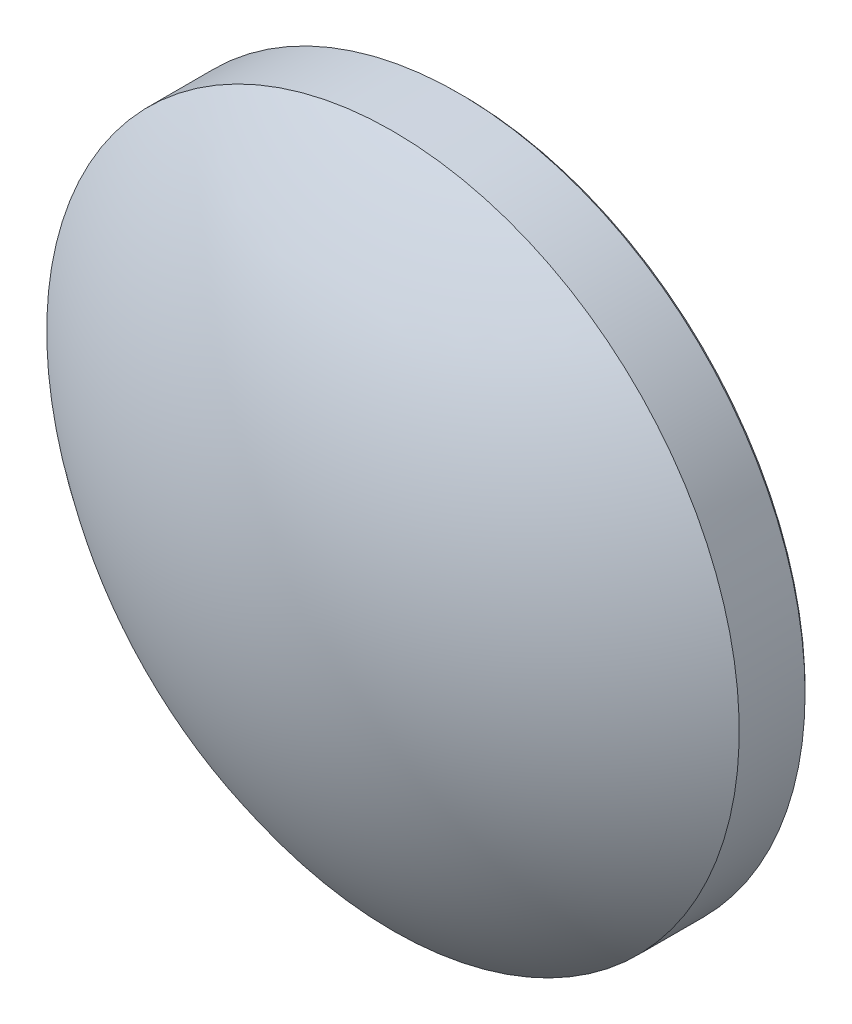
ISO-10303-21;
HEADER;
FILE_DESCRIPTION(('STEP AP214'),'2;1');
FILE_NAME('part.step','',(''),(''),'','','');
FILE_SCHEMA(('AUTOMOTIVE_DESIGN { 1 0 10303 214 1 1 1 1 }'));
ENDSEC;
DATA;
#1=APPLICATION_CONTEXT('core data for automotive mechanical design processes');
#2=APPLICATION_PROTOCOL_DEFINITION('international standard','automotive_design',2000,#1);
#3=PRODUCT_CONTEXT('',#1,'mechanical');
#4=PRODUCT('Part','Part','',(#3));
#5=PRODUCT_RELATED_PRODUCT_CATEGORY('part','',(#4));
#6=PRODUCT_DEFINITION_FORMATION('','',#4);
#7=PRODUCT_DEFINITION_CONTEXT('part definition',#1,'design');
#8=PRODUCT_DEFINITION('design','',#6,#7);
#9=PRODUCT_DEFINITION_SHAPE('','',#8);
#10=(LENGTH_UNIT() NAMED_UNIT(*) SI_UNIT(.MILLI.,.METRE.));
#11=(NAMED_UNIT(*) PLANE_ANGLE_UNIT() SI_UNIT($,.RADIAN.));
#12=(NAMED_UNIT(*) SI_UNIT($,.STERADIAN.) SOLID_ANGLE_UNIT());
#13=UNCERTAINTY_MEASURE_WITH_UNIT(LENGTH_MEASURE(1.E-05),#10,'distance_accuracy_value','');
#14=(GEOMETRIC_REPRESENTATION_CONTEXT(3) GLOBAL_UNCERTAINTY_ASSIGNED_CONTEXT((#13)) GLOBAL_UNIT_ASSIGNED_CONTEXT((#10,
#11,#12)) REPRESENTATION_CONTEXT('',''));
#15=CARTESIAN_POINT('',(0.,0.,0.));
#16=DIRECTION('',(0.,0.,1.));
#17=DIRECTION('',(1.,0.,0.));
#18=AXIS2_PLACEMENT_3D('',#15,#16,#17);
#19=CARTESIAN_POINT('',(0.,0.,-33.11));
#20=DIRECTION('',(0.,0.,1.));
#21=DIRECTION('',(0.,1.,0.));
#22=AXIS2_PLACEMENT_3D('',#19,#20,#21);
#23=SPHERICAL_SURFACE('',#22,40.);
#24=CARTESIAN_POINT('',(0.,0.,-1.88501000800801));
#25=DIRECTION('',(0.,0.,1.));
#26=DIRECTION('',(0.,-1.,0.));
#27=AXIS2_PLACEMENT_3D('',#24,#25,#26);
#28=CIRCLE('',#27,25.);
#29=CARTESIAN_POINT('',(0.,-25.,-1.88501000800801));
#30=VERTEX_POINT('',#29);
#31=EDGE_CURVE('E24',#30,#30,#28,.T.);
#32=ORIENTED_EDGE('',*,*,#31,.T.);
#33=EDGE_LOOP('',(#32));
#34=FACE_BOUND('',#33,.T.);
#35=ADVANCED_FACE('F13',(#34),#23,.T.);
#36=CARTESIAN_POINT('',(0.,0.,6.89));
#37=DIRECTION('',(0.,0.,1.));
#38=DIRECTION('',(0.,-1.,0.));
#39=AXIS2_PLACEMENT_3D('',#36,#37,#38);
#40=CYLINDRICAL_SURFACE('',#39,25.);
#41=CARTESIAN_POINT('',(0.,0.,-6.64));
#42=DIRECTION('',(0.,0.,1.));
#43=DIRECTION('',(1.,0.,0.));
#44=AXIS2_PLACEMENT_3D('',#41,#42,#43);
#45=CIRCLE('',#44,25.);
#46=CARTESIAN_POINT('',(25.,0.,-6.64));
#47=VERTEX_POINT('',#46);
#48=EDGE_CURVE('E20',#47,#47,#45,.T.);
#49=ORIENTED_EDGE('',*,*,#48,.T.);
#50=EDGE_LOOP('',(#49));
#51=FACE_BOUND('',#50,.T.);
#52=ORIENTED_EDGE('',*,*,#31,.F.);
#53=EDGE_LOOP('',(#52));
#54=FACE_BOUND('',#53,.T.);
#55=ADVANCED_FACE('F32',(#51,#54),#40,.T.);
#56=CARTESIAN_POINT('',(0.,0.,-6.89));
#57=DIRECTION('',(0.,0.,1.));
#58=DIRECTION('',(0.,-1.,0.));
#59=AXIS2_PLACEMENT_3D('',#56,#57,#58);
#60=PLANE('',#59);
#61=CARTESIAN_POINT('',(0.,0.,-6.89));
#62=DIRECTION('',(0.,0.,1.));
#63=DIRECTION('',(0.,-1.,0.));
#64=AXIS2_PLACEMENT_3D('',#61,#62,#63);
#65=CIRCLE('',#64,24.75);
#66=CARTESIAN_POINT('',(0.,-24.75,-6.89));
#67=VERTEX_POINT('',#66);
#68=EDGE_CURVE('E9',#67,#67,#65,.F.);
#69=ORIENTED_EDGE('',*,*,#68,.T.);
#70=EDGE_LOOP('',(#69));
#71=FACE_BOUND('',#70,.T.);
#72=ADVANCED_FACE('F34',(#71),#60,.F.);
#73=CARTESIAN_POINT('',(0.,0.,-6.64));
#74=DIRECTION('',(0.,0.,1.));
#75=DIRECTION('',(1.,0.,0.));
#76=AXIS2_PLACEMENT_3D('',#73,#74,#75);
#77=CONICAL_SURFACE('',#76,25.,0.785398163397441);
#78=ORIENTED_EDGE('',*,*,#68,.F.);
#79=EDGE_LOOP('',(#78));
#80=FACE_BOUND('',#79,.T.);
#81=ORIENTED_EDGE('',*,*,#48,.F.);
#82=EDGE_LOOP('',(#81));
#83=FACE_BOUND('',#82,.T.);
#84=ADVANCED_FACE('F15',(#80,#83),#77,.T.);
#85=CLOSED_SHELL('',(#35,#55,#72,#84));
#86=MANIFOLD_SOLID_BREP('B1',#85);
#87=ADVANCED_BREP_SHAPE_REPRESENTATION('',(#18,#86),#14);
#88=SHAPE_DEFINITION_REPRESENTATION(#9,#87);
ENDSEC;
END-ISO-10303-21;
